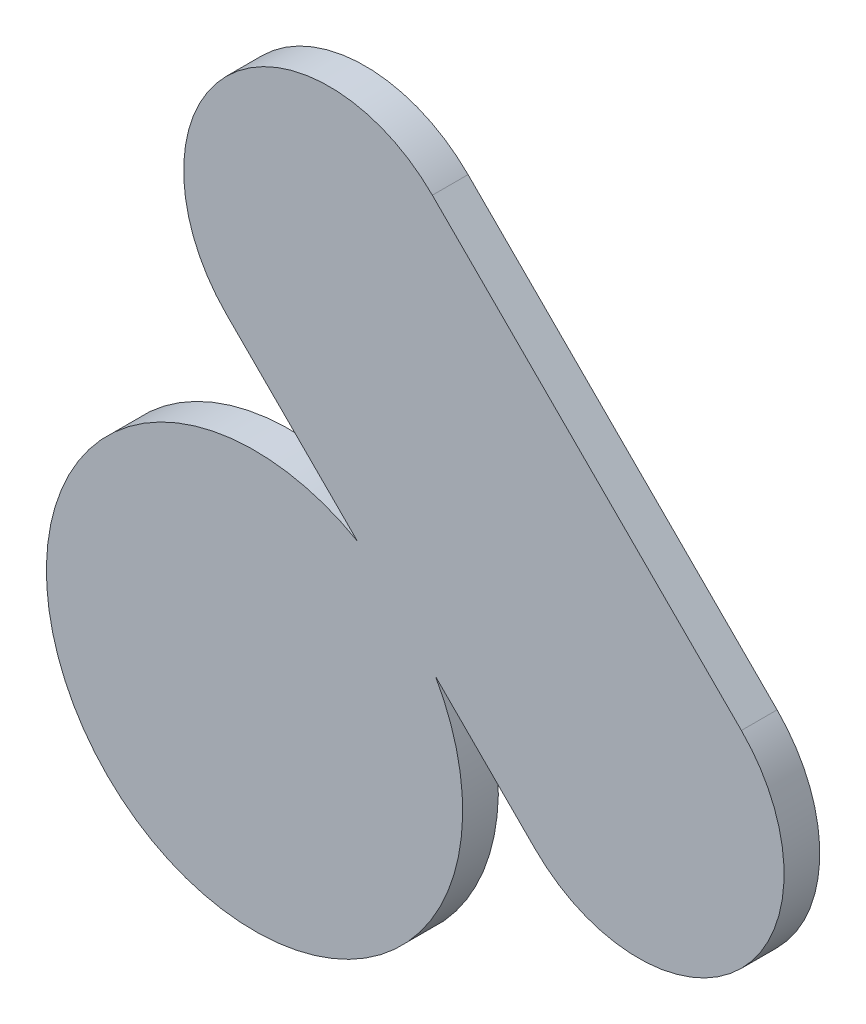
ISO-10303-21;
HEADER;
FILE_DESCRIPTION(('STEP AP214'),'2;1');
FILE_NAME('part.step','',(''),(''),'','','');
FILE_SCHEMA(('AUTOMOTIVE_DESIGN { 1 0 10303 214 1 1 1 1 }'));
ENDSEC;
DATA;
#1=APPLICATION_CONTEXT('core data for automotive mechanical design processes');
#2=APPLICATION_PROTOCOL_DEFINITION('international standard','automotive_design',2000,#1);
#3=PRODUCT_CONTEXT('',#1,'mechanical');
#4=PRODUCT('Part','Part','',(#3));
#5=PRODUCT_RELATED_PRODUCT_CATEGORY('part','',(#4));
#6=PRODUCT_DEFINITION_FORMATION('','',#4);
#7=PRODUCT_DEFINITION_CONTEXT('part definition',#1,'design');
#8=PRODUCT_DEFINITION('design','',#6,#7);
#9=PRODUCT_DEFINITION_SHAPE('','',#8);
#10=(LENGTH_UNIT() NAMED_UNIT(*) SI_UNIT(.MILLI.,.METRE.));
#11=(NAMED_UNIT(*) PLANE_ANGLE_UNIT() SI_UNIT($,.RADIAN.));
#12=(NAMED_UNIT(*) SI_UNIT($,.STERADIAN.) SOLID_ANGLE_UNIT());
#13=UNCERTAINTY_MEASURE_WITH_UNIT(LENGTH_MEASURE(1.E-05),#10,'distance_accuracy_value','');
#14=(GEOMETRIC_REPRESENTATION_CONTEXT(3) GLOBAL_UNCERTAINTY_ASSIGNED_CONTEXT((#13)) GLOBAL_UNIT_ASSIGNED_CONTEXT((#10,
#11,#12)) REPRESENTATION_CONTEXT('',''));
#15=CARTESIAN_POINT('',(0.,0.,0.));
#16=DIRECTION('',(0.,0.,1.));
#17=DIRECTION('',(1.,0.,0.));
#18=AXIS2_PLACEMENT_3D('',#15,#16,#17);
#19=CARTESIAN_POINT('',(5.688475590721,1.992809148391,0.79916));
#20=DIRECTION('',(0.,0.,1.));
#21=DIRECTION('',(0.,-1.,0.));
#22=AXIS2_PLACEMENT_3D('',#19,#20,#21);
#23=PLANE('',#22);
#24=CARTESIAN_POINT('',(5.55625,1.8415,0.79916));
#25=DIRECTION('',(0.,0.,1.));
#26=DIRECTION('',(0.,-1.,0.));
#27=AXIS2_PLACEMENT_3D('',#24,#25,#26);
#28=CIRCLE('',#27,0.2000246675);
#29=CARTESIAN_POINT('',(5.73016384599903,1.94031215400096,0.79916));
#30=VERTEX_POINT('',#29);
#31=CARTESIAN_POINT('',(5.65506215518465,2.01541384532635,0.79916));
#32=VERTEX_POINT('',#31);
#33=EDGE_CURVE('E20',#30,#32,#28,.F.);
#34=ORIENTED_EDGE('',*,*,#33,.F.);
#35=DIRECTION('',(-0.707109234522792,0.707104327841792,0.));
#36=VECTOR('',#35,1.);
#37=CARTESIAN_POINT('',(5.826142333001,1.844334333001,0.79916));
#38=LINE('',#37,#36);
#39=CARTESIAN_POINT('',(5.82614253005252,1.84433413595085,0.79916));
#40=VERTEX_POINT('',#39);
#41=EDGE_CURVE('E76',#30,#40,#38,.F.);
#42=ORIENTED_EDGE('',*,*,#41,.T.);
#43=CARTESIAN_POINT('',(5.925137333,1.943328667,0.79916));
#44=DIRECTION('',(0.,0.,1.));
#45=DIRECTION('',(0.,-1.,0.));
#46=AXIS2_PLACEMENT_3D('',#43,#44,#45);
#47=CIRCLE('',#46,0.140000071608);
#48=CARTESIAN_POINT('',(6.02413222199987,2.04232377799955,0.79916));
#49=VERTEX_POINT('',#48);
#50=EDGE_CURVE('E97',#49,#40,#47,.F.);
#51=ORIENTED_EDGE('',*,*,#50,.F.);
#52=DIRECTION('',(0.707105988327103,-0.707107574045103,0.));
#53=VECTOR('',#52,1.);
#54=CARTESIAN_POINT('',(5.727147666001,2.339309,0.79916));
#55=LINE('',#54,#53);
#56=CARTESIAN_POINT('',(5.72714769618403,2.3393089698169,0.79916));
#57=VERTEX_POINT('',#56);
#58=EDGE_CURVE('E96',#49,#57,#55,.F.);
#59=ORIENTED_EDGE('',*,*,#58,.T.);
#60=CARTESIAN_POINT('',(5.628152333,2.240313768268,0.79916));
#61=DIRECTION('',(0.,0.,1.));
#62=DIRECTION('',(0.,-1.,0.));
#63=AXIS2_PLACEMENT_3D('',#60,#61,#62);
#64=CIRCLE('',#63,0.140000470934);
#65=CARTESIAN_POINT('',(5.52915716660037,2.14131883339912,0.79916));
#66=VERTEX_POINT('',#65);
#67=EDGE_CURVE('E80',#66,#57,#64,.F.);
#68=ORIENTED_EDGE('',*,*,#67,.F.);
#69=DIRECTION('',(-0.707106782624047,0.707106779749048,0.));
#70=VECTOR('',#69,1.);
#71=CARTESIAN_POINT('',(5.655062155185,2.015413845326,0.79916));
#72=LINE('',#71,#70);
#73=EDGE_CURVE('E78',#66,#32,#72,.F.);
#74=ORIENTED_EDGE('',*,*,#73,.T.);
#75=EDGE_LOOP('',(#34,#42,#51,#59,#68,#74));
#76=FACE_BOUND('',#75,.T.);
#77=ADVANCED_FACE('F17',(#76),#23,.T.);
#78=CARTESIAN_POINT('',(5.826142333001,1.844334333001,0.76487));
#79=DIRECTION('',(0.707104327841792,0.707109234522792,0.));
#80=DIRECTION('',(-0.707109234522792,0.707104327841792,0.));
#81=AXIS2_PLACEMENT_3D('',#78,#79,#80);
#82=PLANE('',#81);
#83=DIRECTION('',(0.,0.,1.));
#84=VECTOR('',#83,1.);
#85=CARTESIAN_POINT('',(5.73016384599968,1.94031215399982,0.76487));
#86=LINE('',#85,#84);
#87=CARTESIAN_POINT('',(5.73016384599936,1.94031215400039,0.76487));
#88=VERTEX_POINT('',#87);
#89=EDGE_CURVE('E72',#88,#30,#86,.T.);
#90=ORIENTED_EDGE('',*,*,#89,.F.);
#91=DIRECTION('',(-0.707109234524595,0.707104327839988,0.));
#92=VECTOR('',#91,1.);
#93=CARTESIAN_POINT('',(5.826142333001,1.844334333001,0.76487));
#94=LINE('',#93,#92);
#95=CARTESIAN_POINT('',(5.82614253005265,1.84433413595072,0.76487));
#96=VERTEX_POINT('',#95);
#97=EDGE_CURVE('E104',#96,#88,#94,.T.);
#98=ORIENTED_EDGE('',*,*,#97,.F.);
#99=DIRECTION('',(0.,0.,1.));
#100=VECTOR('',#99,1.);
#101=CARTESIAN_POINT('',(5.826142333001,1.844334333001,0.76487));
#102=LINE('',#101,#100);
#103=EDGE_CURVE('E94',#40,#96,#102,.F.);
#104=ORIENTED_EDGE('',*,*,#103,.F.);
#105=ORIENTED_EDGE('',*,*,#41,.F.);
#106=EDGE_LOOP('',(#90,#98,#104,#105));
#107=FACE_BOUND('',#106,.T.);
#108=ADVANCED_FACE('F127',(#107),#82,.F.);
#109=CARTESIAN_POINT('',(5.55625,1.8415,0.76487));
#110=DIRECTION('',(0.,0.,1.));
#111=DIRECTION('',(0.,-1.,0.));
#112=AXIS2_PLACEMENT_3D('',#109,#110,#111);
#113=CYLINDRICAL_SURFACE('',#112,0.2000246675);
#114=CARTESIAN_POINT('',(5.55625,1.8415,0.76487));
#115=DIRECTION('',(0.,0.,1.));
#116=DIRECTION('',(0.,-1.,0.));
#117=AXIS2_PLACEMENT_3D('',#114,#115,#116);
#118=CIRCLE('',#117,0.2000246675);
#119=CARTESIAN_POINT('',(5.65506215518465,2.01541384532635,0.76487));
#120=VERTEX_POINT('',#119);
#121=EDGE_CURVE('E102',#88,#120,#118,.F.);
#122=ORIENTED_EDGE('',*,*,#121,.F.);
#123=ORIENTED_EDGE('',*,*,#89,.T.);
#124=ORIENTED_EDGE('',*,*,#33,.T.);
#125=DIRECTION('',(0.,0.,1.));
#126=VECTOR('',#125,1.);
#127=CARTESIAN_POINT('',(5.655062155185,2.015413845326,0.76487));
#128=LINE('',#127,#126);
#129=EDGE_CURVE('E70',#32,#120,#128,.F.);
#130=ORIENTED_EDGE('',*,*,#129,.T.);
#131=EDGE_LOOP('',(#122,#123,#124,#130));
#132=FACE_BOUND('',#131,.T.);
#133=ADVANCED_FACE('F68',(#132),#113,.T.);
#134=CARTESIAN_POINT('',(5.655062155185,2.015413845326,0.76487));
#135=DIRECTION('',(0.707106779749048,0.707106782624047,0.));
#136=DIRECTION('',(-0.707106782624047,0.707106779749048,0.));
#137=AXIS2_PLACEMENT_3D('',#134,#135,#136);
#138=PLANE('',#137);
#139=DIRECTION('',(0.,0.,1.));
#140=VECTOR('',#139,1.);
#141=CARTESIAN_POINT('',(5.52915733299994,2.14131866699994,0.76487));
#142=LINE('',#141,#140);
#143=CARTESIAN_POINT('',(5.52915716660042,2.14131883339952,0.76487));
#144=VERTEX_POINT('',#143);
#145=EDGE_CURVE('E83',#144,#66,#142,.T.);
#146=ORIENTED_EDGE('',*,*,#145,.F.);
#147=DIRECTION('',(-0.707106782621487,0.707106779751608,0.));
#148=VECTOR('',#147,1.);
#149=CARTESIAN_POINT('',(5.655062155185,2.015413845326,0.76487));
#150=LINE('',#149,#148);
#151=EDGE_CURVE('E87',#120,#144,#150,.T.);
#152=ORIENTED_EDGE('',*,*,#151,.F.);
#153=ORIENTED_EDGE('',*,*,#129,.F.);
#154=ORIENTED_EDGE('',*,*,#73,.F.);
#155=EDGE_LOOP('',(#146,#152,#153,#154));
#156=FACE_BOUND('',#155,.T.);
#157=ADVANCED_FACE('F85',(#156),#138,.F.);
#158=CARTESIAN_POINT('',(5.628152333,2.240313768268,0.76487));
#159=DIRECTION('',(0.,0.,1.));
#160=DIRECTION('',(0.,-1.,0.));
#161=AXIS2_PLACEMENT_3D('',#158,#159,#160);
#162=CYLINDRICAL_SURFACE('',#161,0.140000470934);
#163=DIRECTION('',(0.,0.,1.));
#164=VECTOR('',#163,1.);
#165=CARTESIAN_POINT('',(5.727147666001,2.339309,0.76487));
#166=LINE('',#165,#164);
#167=CARTESIAN_POINT('',(5.72714769618402,2.33930896981691,0.76487));
#168=VERTEX_POINT('',#167);
#169=EDGE_CURVE('E98',#57,#168,#166,.F.);
#170=ORIENTED_EDGE('',*,*,#169,.T.);
#171=CARTESIAN_POINT('',(5.628152,2.240314,0.76487));
#172=DIRECTION('',(0.,0.,1.));
#173=DIRECTION('',(0.,-1.,0.));
#174=AXIS2_PLACEMENT_3D('',#171,#172,#173);
#175=CIRCLE('',#174,0.140000071608);
#176=EDGE_CURVE('E26',#144,#168,#175,.F.);
#177=ORIENTED_EDGE('',*,*,#176,.F.);
#178=ORIENTED_EDGE('',*,*,#145,.T.);
#179=ORIENTED_EDGE('',*,*,#67,.T.);
#180=EDGE_LOOP('',(#170,#177,#178,#179));
#181=FACE_BOUND('',#180,.T.);
#182=ADVANCED_FACE('F111',(#181),#162,.T.);
#183=CARTESIAN_POINT('',(5.727147666001,2.339309,0.76487));
#184=DIRECTION('',(-0.707107574045103,-0.707105988327103,0.));
#185=DIRECTION('',(0.707105988327103,-0.707107574045103,0.));
#186=AXIS2_PLACEMENT_3D('',#183,#184,#185);
#187=PLANE('',#186);
#188=DIRECTION('',(0.,0.,1.));
#189=VECTOR('',#188,1.);
#190=CARTESIAN_POINT('',(6.02413200000006,2.04232400000006,0.76487));
#191=LINE('',#190,#189);
#192=CARTESIAN_POINT('',(6.02413222199991,2.04232377799962,0.76487));
#193=VERTEX_POINT('',#192);
#194=EDGE_CURVE('E106',#193,#49,#191,.T.);
#195=ORIENTED_EDGE('',*,*,#194,.F.);
#196=DIRECTION('',(0.707105988327286,-0.70710757404492,0.));
#197=VECTOR('',#196,1.);
#198=CARTESIAN_POINT('',(5.727147666001,2.339309,0.76487));
#199=LINE('',#198,#197);
#200=EDGE_CURVE('E11',#168,#193,#199,.T.);
#201=ORIENTED_EDGE('',*,*,#200,.F.);
#202=ORIENTED_EDGE('',*,*,#169,.F.);
#203=ORIENTED_EDGE('',*,*,#58,.F.);
#204=EDGE_LOOP('',(#195,#201,#202,#203));
#205=FACE_BOUND('',#204,.T.);
#206=ADVANCED_FACE('F123',(#205),#187,.F.);
#207=CARTESIAN_POINT('',(5.925137333,1.943328667,0.76487));
#208=DIRECTION('',(0.,0.,1.));
#209=DIRECTION('',(0.,-1.,0.));
#210=AXIS2_PLACEMENT_3D('',#207,#208,#209);
#211=CYLINDRICAL_SURFACE('',#210,0.140000071608);
#212=CARTESIAN_POINT('',(5.925137333001,1.943329231733,0.76487));
#213=DIRECTION('',(0.,0.,1.));
#214=DIRECTION('',(0.,-1.,0.));
#215=AXIS2_PLACEMENT_3D('',#212,#213,#214);
#216=CIRCLE('',#215,0.14);
#217=EDGE_CURVE('E35',#193,#96,#216,.F.);
#218=ORIENTED_EDGE('',*,*,#217,.F.);
#219=ORIENTED_EDGE('',*,*,#194,.T.);
#220=ORIENTED_EDGE('',*,*,#50,.T.);
#221=ORIENTED_EDGE('',*,*,#103,.T.);
#222=EDGE_LOOP('',(#218,#219,#220,#221));
#223=FACE_BOUND('',#222,.T.);
#224=ADVANCED_FACE('F120',(#223),#211,.T.);
#225=CARTESIAN_POINT('',(5.688475590721,1.992809148391,0.76487));
#226=DIRECTION('',(0.,0.,-1.));
#227=DIRECTION('',(0.,1.,0.));
#228=AXIS2_PLACEMENT_3D('',#225,#226,#227);
#229=PLANE('',#228);
#230=ORIENTED_EDGE('',*,*,#200,.T.);
#231=ORIENTED_EDGE('',*,*,#217,.T.);
#232=ORIENTED_EDGE('',*,*,#97,.T.);
#233=ORIENTED_EDGE('',*,*,#121,.T.);
#234=ORIENTED_EDGE('',*,*,#151,.T.);
#235=ORIENTED_EDGE('',*,*,#176,.T.);
#236=EDGE_LOOP('',(#230,#231,#232,#233,#234,#235));
#237=FACE_BOUND('',#236,.T.);
#238=ADVANCED_FACE('F115',(#237),#229,.T.);
#239=CLOSED_SHELL('',(#77,#108,#133,#157,#182,#206,#224,#238));
#240=MANIFOLD_SOLID_BREP('B1',#239);
#241=ADVANCED_BREP_SHAPE_REPRESENTATION('',(#18,#240),#14);
#242=SHAPE_DEFINITION_REPRESENTATION(#9,#241);
ENDSEC;
END-ISO-10303-21;
